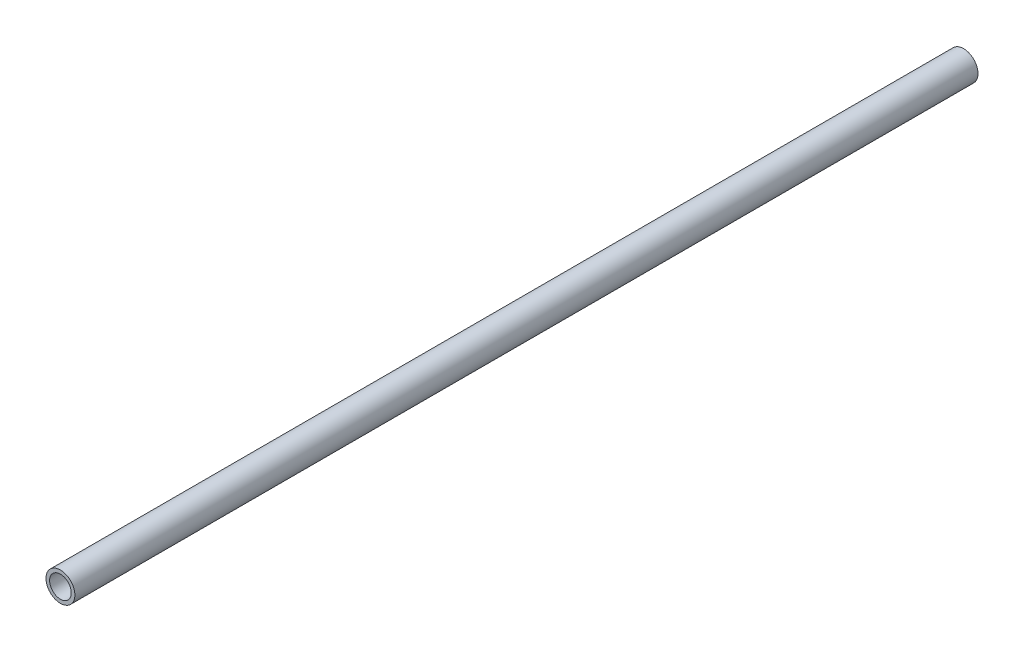
ISO-10303-21;
HEADER;
FILE_DESCRIPTION(('STEP AP214'),'2;1');
FILE_NAME('part.step','',(''),(''),'','','');
FILE_SCHEMA(('AUTOMOTIVE_DESIGN { 1 0 10303 214 1 1 1 1 }'));
ENDSEC;
DATA;
#1=APPLICATION_CONTEXT('core data for automotive mechanical design processes');
#2=APPLICATION_PROTOCOL_DEFINITION('international standard','automotive_design',2000,#1);
#3=PRODUCT_CONTEXT('',#1,'mechanical');
#4=PRODUCT('Part','Part','',(#3));
#5=PRODUCT_RELATED_PRODUCT_CATEGORY('part','',(#4));
#6=PRODUCT_DEFINITION_FORMATION('','',#4);
#7=PRODUCT_DEFINITION_CONTEXT('part definition',#1,'design');
#8=PRODUCT_DEFINITION('design','',#6,#7);
#9=PRODUCT_DEFINITION_SHAPE('','',#8);
#10=(LENGTH_UNIT() NAMED_UNIT(*) SI_UNIT(.MILLI.,.METRE.));
#11=(NAMED_UNIT(*) PLANE_ANGLE_UNIT() SI_UNIT($,.RADIAN.));
#12=(NAMED_UNIT(*) SI_UNIT($,.STERADIAN.) SOLID_ANGLE_UNIT());
#13=UNCERTAINTY_MEASURE_WITH_UNIT(LENGTH_MEASURE(1.E-05),#10,'distance_accuracy_value','');
#14=(GEOMETRIC_REPRESENTATION_CONTEXT(3) GLOBAL_UNCERTAINTY_ASSIGNED_CONTEXT((#13)) GLOBAL_UNIT_ASSIGNED_CONTEXT((#10,
#11,#12)) REPRESENTATION_CONTEXT('',''));
#15=CARTESIAN_POINT('',(0.,0.,0.));
#16=DIRECTION('',(0.,0.,1.));
#17=DIRECTION('',(1.,0.,0.));
#18=AXIS2_PLACEMENT_3D('',#15,#16,#17);
#19=CARTESIAN_POINT('',(0.,0.,250.));
#20=DIRECTION('',(0.,0.,1.));
#21=DIRECTION('',(1.,0.,0.));
#22=AXIS2_PLACEMENT_3D('',#19,#20,#21);
#23=PLANE('',#22);
#24=CARTESIAN_POINT('',(0.,0.,250.));
#25=DIRECTION('',(0.,0.,1.));
#26=DIRECTION('',(1.,0.,0.));
#27=AXIS2_PLACEMENT_3D('',#24,#25,#26);
#28=CIRCLE('',#27,4.);
#29=CARTESIAN_POINT('',(4.,0.,250.));
#30=VERTEX_POINT('',#29);
#31=EDGE_CURVE('E10',#30,#30,#28,.T.);
#32=ORIENTED_EDGE('',*,*,#31,.T.);
#33=EDGE_LOOP('',(#32));
#34=FACE_BOUND('',#33,.T.);
#35=CARTESIAN_POINT('',(0.,0.,250.));
#36=DIRECTION('',(0.,0.,1.));
#37=DIRECTION('',(1.,0.,0.));
#38=AXIS2_PLACEMENT_3D('',#35,#36,#37);
#39=CIRCLE('',#38,3.);
#40=CARTESIAN_POINT('',(3.,0.,250.));
#41=VERTEX_POINT('',#40);
#42=EDGE_CURVE('E44',#41,#41,#39,.T.);
#43=ORIENTED_EDGE('',*,*,#42,.F.);
#44=EDGE_LOOP('',(#43));
#45=FACE_BOUND('',#44,.T.);
#46=ADVANCED_FACE('F33',(#34,#45),#23,.T.);
#47=CARTESIAN_POINT('',(0.,0.,0.));
#48=DIRECTION('',(0.,0.,1.));
#49=DIRECTION('',(1.,0.,0.));
#50=AXIS2_PLACEMENT_3D('',#47,#48,#49);
#51=PLANE('',#50);
#52=CARTESIAN_POINT('',(0.,0.,0.));
#53=DIRECTION('',(0.,0.,1.));
#54=DIRECTION('',(1.,0.,0.));
#55=AXIS2_PLACEMENT_3D('',#52,#53,#54);
#56=CIRCLE('',#55,4.);
#57=CARTESIAN_POINT('',(4.,0.,0.));
#58=VERTEX_POINT('',#57);
#59=EDGE_CURVE('E37',#58,#58,#56,.T.);
#60=ORIENTED_EDGE('',*,*,#59,.F.);
#61=EDGE_LOOP('',(#60));
#62=FACE_BOUND('',#61,.T.);
#63=CARTESIAN_POINT('',(0.,0.,0.));
#64=DIRECTION('',(0.,0.,1.));
#65=DIRECTION('',(1.,0.,0.));
#66=AXIS2_PLACEMENT_3D('',#63,#64,#65);
#67=CIRCLE('',#66,3.);
#68=CARTESIAN_POINT('',(3.,0.,0.));
#69=VERTEX_POINT('',#68);
#70=EDGE_CURVE('E46',#69,#69,#67,.T.);
#71=ORIENTED_EDGE('',*,*,#70,.T.);
#72=EDGE_LOOP('',(#71));
#73=FACE_BOUND('',#72,.T.);
#74=ADVANCED_FACE('F56',(#62,#73),#51,.F.);
#75=CARTESIAN_POINT('',(0.,0.,250.));
#76=DIRECTION('',(0.,0.,-1.));
#77=DIRECTION('',(-1.,0.,0.));
#78=AXIS2_PLACEMENT_3D('',#75,#76,#77);
#79=CYLINDRICAL_SURFACE('',#78,4.);
#80=ORIENTED_EDGE('',*,*,#31,.F.);
#81=EDGE_LOOP('',(#80));
#82=FACE_BOUND('',#81,.T.);
#83=ORIENTED_EDGE('',*,*,#59,.T.);
#84=EDGE_LOOP('',(#83));
#85=FACE_BOUND('',#84,.T.);
#86=ADVANCED_FACE('F35',(#82,#85),#79,.T.);
#87=CARTESIAN_POINT('',(0.,0.,250.));
#88=DIRECTION('',(0.,0.,-1.));
#89=DIRECTION('',(-1.,0.,0.));
#90=AXIS2_PLACEMENT_3D('',#87,#88,#89);
#91=CYLINDRICAL_SURFACE('',#90,3.);
#92=ORIENTED_EDGE('',*,*,#42,.T.);
#93=EDGE_LOOP('',(#92));
#94=FACE_BOUND('',#93,.T.);
#95=ORIENTED_EDGE('',*,*,#70,.F.);
#96=EDGE_LOOP('',(#95));
#97=FACE_BOUND('',#96,.T.);
#98=ADVANCED_FACE('F52',(#94,#97),#91,.F.);
#99=CLOSED_SHELL('',(#46,#74,#86,#98));
#100=MANIFOLD_SOLID_BREP('B2',#99);
#101=ADVANCED_BREP_SHAPE_REPRESENTATION('',(#18,#100),#14);
#102=SHAPE_DEFINITION_REPRESENTATION(#9,#101);
ENDSEC;
END-ISO-10303-21;
